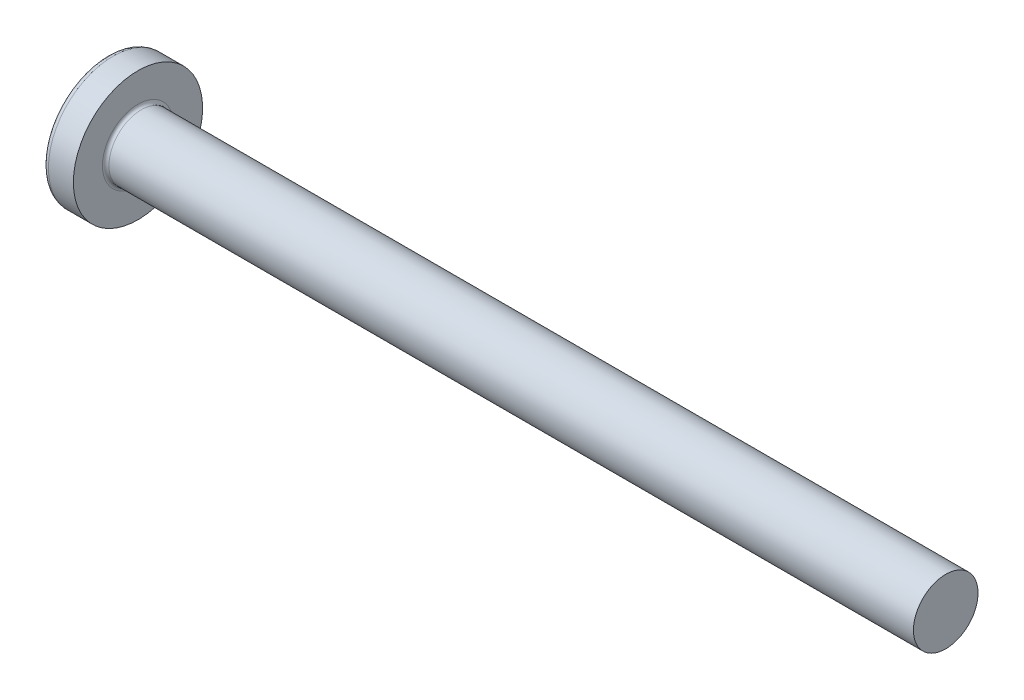
ISO-10303-21;
HEADER;
FILE_DESCRIPTION(('STEP AP214'),'2;1');
FILE_NAME('part.step','',(''),(''),'','','');
FILE_SCHEMA(('AUTOMOTIVE_DESIGN { 1 0 10303 214 1 1 1 1 }'));
ENDSEC;
DATA;
#1=APPLICATION_CONTEXT('core data for automotive mechanical design processes');
#2=APPLICATION_PROTOCOL_DEFINITION('international standard','automotive_design',2000,#1);
#3=PRODUCT_CONTEXT('',#1,'mechanical');
#4=PRODUCT('Part','Part','',(#3));
#5=PRODUCT_RELATED_PRODUCT_CATEGORY('part','',(#4));
#6=PRODUCT_DEFINITION_FORMATION('','',#4);
#7=PRODUCT_DEFINITION_CONTEXT('part definition',#1,'design');
#8=PRODUCT_DEFINITION('design','',#6,#7);
#9=PRODUCT_DEFINITION_SHAPE('','',#8);
#10=(LENGTH_UNIT() NAMED_UNIT(*) SI_UNIT(.MILLI.,.METRE.));
#11=(NAMED_UNIT(*) PLANE_ANGLE_UNIT() SI_UNIT($,.RADIAN.));
#12=(NAMED_UNIT(*) SI_UNIT($,.STERADIAN.) SOLID_ANGLE_UNIT());
#13=UNCERTAINTY_MEASURE_WITH_UNIT(LENGTH_MEASURE(1.E-05),#10,'distance_accuracy_value','');
#14=(GEOMETRIC_REPRESENTATION_CONTEXT(3) GLOBAL_UNCERTAINTY_ASSIGNED_CONTEXT((#13)) GLOBAL_UNIT_ASSIGNED_CONTEXT((#10,
#11,#12)) REPRESENTATION_CONTEXT('',''));
#15=CARTESIAN_POINT('',(0.,0.,0.));
#16=DIRECTION('',(0.,0.,1.));
#17=DIRECTION('',(1.,0.,0.));
#18=AXIS2_PLACEMENT_3D('',#15,#16,#17);
#19=CARTESIAN_POINT('',(6.5,0.,0.));
#20=DIRECTION('',(-1.,0.,0.));
#21=DIRECTION('',(0.,1.,0.));
#22=AXIS2_PLACEMENT_3D('',#19,#20,#21);
#23=SPHERICAL_SURFACE('',#22,6.5);
#24=CARTESIAN_POINT('',(1.26538895452803,0.,0.));
#25=DIRECTION('',(-1.,0.,0.));
#26=DIRECTION('',(0.,0.,1.));
#27=AXIS2_PLACEMENT_3D('',#24,#25,#26);
#28=CIRCLE('',#27,3.85342019543974);
#29=CARTESIAN_POINT('',(1.26538895452803,0.,3.85342019543974));
#30=VERTEX_POINT('',#29);
#31=EDGE_CURVE('E211',#30,#30,#28,.T.);
#32=ORIENTED_EDGE('',*,*,#31,.T.);
#33=EDGE_LOOP('',(#32));
#34=FACE_BOUND('',#33,.T.);
#35=CARTESIAN_POINT('',(0.0788099820016241,0.,0.));
#36=DIRECTION('',(1.,0.,0.));
#37=DIRECTION('',(0.,0.,-1.));
#38=AXIS2_PLACEMENT_3D('',#35,#36,#37);
#39=CIRCLE('',#38,1.0091178091571);
#40=CARTESIAN_POINT('',(0.0788099820016235,-0.514999999999997,-0.867809744562728));
#41=VERTEX_POINT('',#40);
#42=CARTESIAN_POINT('',(0.0788099820016245,-0.867809744562729,-0.515));
#43=VERTEX_POINT('',#42);
#44=EDGE_CURVE('E337',#41,#43,#39,.F.);
#45=ORIENTED_EDGE('',*,*,#44,.F.);
#46=CARTESIAN_POINT('',(6.5,-0.515,0.));
#47=DIRECTION('',(0.,1.,0.));
#48=DIRECTION('',(0.,0.,1.));
#49=AXIS2_PLACEMENT_3D('',#46,#47,#48);
#50=CIRCLE('',#49,6.47956595768575);
#51=CARTESIAN_POINT('',(0.331830514069448,-0.514999999999993,-1.98455541440274));
#52=VERTEX_POINT('',#51);
#53=EDGE_CURVE('E271',#52,#41,#50,.T.);
#54=ORIENTED_EDGE('',*,*,#53,.F.);
#55=CARTESIAN_POINT('',(6.06443205224295,0.,0.873614180207961));
#56=DIRECTION('',(0.446197800778958,0.,-0.89493436774996));
#57=DIRECTION('',(-0.89493436774996,0.,-0.446197800778958));
#58=AXIS2_PLACEMENT_3D('',#55,#56,#57);
#59=CIRCLE('',#58,6.4262803258982);
#60=CARTESIAN_POINT('',(0.331830514069448,0.515000000000007,-1.98455541440274));
#61=VERTEX_POINT('',#60);
#62=EDGE_CURVE('E245',#52,#61,#59,.T.);
#63=ORIENTED_EDGE('',*,*,#62,.T.);
#64=CARTESIAN_POINT('',(6.5,0.515,0.));
#65=DIRECTION('',(0.,-1.,0.));
#66=DIRECTION('',(0.,0.,-1.));
#67=AXIS2_PLACEMENT_3D('',#64,#65,#66);
#68=CIRCLE('',#67,6.47956595768575);
#69=CARTESIAN_POINT('',(0.0788099820016234,0.515000000000003,-0.867809744562724));
#70=VERTEX_POINT('',#69);
#71=EDGE_CURVE('E299',#70,#61,#68,.T.);
#72=ORIENTED_EDGE('',*,*,#71,.F.);
#73=CARTESIAN_POINT('',(0.0788099820016245,0.86780974456273,-0.515));
#74=VERTEX_POINT('',#73);
#75=EDGE_CURVE('E352',#74,#70,#39,.F.);
#76=ORIENTED_EDGE('',*,*,#75,.F.);
#77=CARTESIAN_POINT('',(6.5,0.,-0.515));
#78=DIRECTION('',(0.,0.,1.));
#79=DIRECTION('',(1.,0.,0.));
#80=AXIS2_PLACEMENT_3D('',#77,#78,#79);
#81=CIRCLE('',#80,6.47956595768575);
#82=CARTESIAN_POINT('',(0.331830514069446,1.98455541440274,-0.515));
#83=VERTEX_POINT('',#82);
#84=EDGE_CURVE('E239',#83,#74,#81,.T.);
#85=ORIENTED_EDGE('',*,*,#84,.F.);
#86=CARTESIAN_POINT('',(6.06443205224295,-0.873614180207961,0.));
#87=DIRECTION('',(0.446197800778958,0.89493436774996,0.));
#88=DIRECTION('',(-0.89493436774996,0.446197800778958,0.));
#89=AXIS2_PLACEMENT_3D('',#86,#87,#88);
#90=CIRCLE('',#89,6.4262803258982);
#91=CARTESIAN_POINT('',(0.331830514069447,1.98455541440274,0.515));
#92=VERTEX_POINT('',#91);
#93=EDGE_CURVE('E242',#83,#92,#90,.T.);
#94=ORIENTED_EDGE('',*,*,#93,.T.);
#95=CARTESIAN_POINT('',(6.5,0.,0.515));
#96=DIRECTION('',(0.,0.,-1.));
#97=DIRECTION('',(0.,1.,0.));
#98=AXIS2_PLACEMENT_3D('',#95,#96,#97);
#99=CIRCLE('',#98,6.47956595768575);
#100=CARTESIAN_POINT('',(0.0788099820016241,0.867809744562726,0.515));
#101=VERTEX_POINT('',#100);
#102=EDGE_CURVE('E235',#101,#92,#99,.T.);
#103=ORIENTED_EDGE('',*,*,#102,.F.);
#104=CARTESIAN_POINT('',(0.0788099820016234,0.514999999999997,0.867809744562728));
#105=VERTEX_POINT('',#104);
#106=EDGE_CURVE('E351',#105,#101,#39,.F.);
#107=ORIENTED_EDGE('',*,*,#106,.F.);
#108=CARTESIAN_POINT('',(0.331830514069447,0.514999999999993,1.98455541440274));
#109=VERTEX_POINT('',#108);
#110=EDGE_CURVE('E255',#109,#105,#68,.T.);
#111=ORIENTED_EDGE('',*,*,#110,.F.);
#112=CARTESIAN_POINT('',(6.06443205224295,0.,-0.873614180207961));
#113=DIRECTION('',(0.446197800778958,0.,0.89493436774996));
#114=DIRECTION('',(0.89493436774996,0.,-0.446197800778958));
#115=AXIS2_PLACEMENT_3D('',#112,#113,#114);
#116=CIRCLE('',#115,6.4262803258982);
#117=CARTESIAN_POINT('',(0.331830514069447,-0.515000000000007,1.98455541440274));
#118=VERTEX_POINT('',#117);
#119=EDGE_CURVE('E46',#109,#118,#116,.T.);
#120=ORIENTED_EDGE('',*,*,#119,.T.);
#121=CARTESIAN_POINT('',(0.0788099820016234,-0.515000000000003,0.867809744562724));
#122=VERTEX_POINT('',#121);
#123=EDGE_CURVE('E252',#122,#118,#50,.T.);
#124=ORIENTED_EDGE('',*,*,#123,.F.);
#125=CARTESIAN_POINT('',(0.0788099820016241,-0.867809744562726,0.515));
#126=VERTEX_POINT('',#125);
#127=EDGE_CURVE('E383',#126,#122,#39,.F.);
#128=ORIENTED_EDGE('',*,*,#127,.F.);
#129=CARTESIAN_POINT('',(0.331830514069448,-1.98455541440274,0.515));
#130=VERTEX_POINT('',#129);
#131=EDGE_CURVE('E236',#130,#126,#99,.T.);
#132=ORIENTED_EDGE('',*,*,#131,.F.);
#133=CARTESIAN_POINT('',(6.06443205224295,0.873614180207961,0.));
#134=DIRECTION('',(0.446197800778958,-0.89493436774996,0.));
#135=DIRECTION('',(0.89493436774996,0.446197800778958,0.));
#136=AXIS2_PLACEMENT_3D('',#133,#134,#135);
#137=CIRCLE('',#136,6.4262803258982);
#138=CARTESIAN_POINT('',(0.331830514069448,-1.98455541440274,-0.515));
#139=VERTEX_POINT('',#138);
#140=EDGE_CURVE('E232',#130,#139,#137,.T.);
#141=ORIENTED_EDGE('',*,*,#140,.T.);
#142=EDGE_CURVE('E61',#43,#139,#81,.T.);
#143=ORIENTED_EDGE('',*,*,#142,.F.);
#144=EDGE_LOOP('',(#45,#54,#63,#72,#76,#85,#94,#103,#107,#111,#120,#124,#128,#132,#141,#143));
#145=FACE_BOUND('',#144,.T.);
#146=ADVANCED_FACE('F33',(#34,#145),#23,.T.);
#147=CARTESIAN_POINT('',(0.,2.15,-0.515));
#148=DIRECTION('',(0.,0.,1.));
#149=DIRECTION('',(1.,0.,0.));
#150=AXIS2_PLACEMENT_3D('',#147,#148,#149);
#151=PLANE('',#150);
#152=ORIENTED_EDGE('',*,*,#84,.T.);
#153=CARTESIAN_POINT('',(-1.51195208675156,0.994972220320188,-0.515));
#154=CARTESIAN_POINT('',(-1.2040598194928,0.970722016949958,-0.515));
#155=CARTESIAN_POINT('',(-0.896180907521175,0.946299109919651,-0.515));
#156=CARTESIAN_POINT('',(-0.280449079832186,0.896981122427851,-0.515));
#157=CARTESIAN_POINT('',(0.0274038344396859,0.872086023934883,-0.515));
#158=CARTESIAN_POINT('',(0.48914673951535,0.83429553519528,-0.515));
#159=CARTESIAN_POINT('',(0.643055047553845,0.821624058404092,-0.515));
#160=CARTESIAN_POINT('',(0.950856520197139,0.796108332639504,-0.515));
#161=CARTESIAN_POINT('',(1.10474968487868,0.783264084592466,-0.515));
#162=CARTESIAN_POINT('',(1.41251352095103,0.757376569093378,-0.515));
#163=CARTESIAN_POINT('',(1.56638419296577,0.744333309065218,-0.515));
#164=CARTESIAN_POINT('',(1.87410847343335,0.718013273188896,-0.515));
#165=CARTESIAN_POINT('',(2.02796208151372,0.704736492982792,-0.515));
#166=CARTESIAN_POINT('',(2.36455311890989,0.675386943006726,-0.515));
#167=CARTESIAN_POINT('',(2.54728562293342,0.659257575640986,-0.515));
#168=CARTESIAN_POINT('',(2.91270624109256,0.626517182479888,-0.515));
#169=CARTESIAN_POINT('',(3.09539435554038,0.609906160177238,-0.515));
#170=CARTESIAN_POINT('',(3.46069832191613,0.576073027116421,-0.515));
#171=CARTESIAN_POINT('',(3.64331417870068,0.558850968932727,-0.515));
#172=CARTESIAN_POINT('',(4.00847437496567,0.523604864540037,-0.515));
#173=CARTESIAN_POINT('',(4.19101871216888,0.505580794604253,-0.515));
#174=CARTESIAN_POINT('',(4.55606208157937,0.468429191666488,-0.515));
#175=CARTESIAN_POINT('',(4.73856107358023,0.449301262281854,-0.515));
#176=CARTESIAN_POINT('',(5.10337547353419,0.409473604748924,-0.515));
#177=CARTESIAN_POINT('',(5.28569089526422,0.388774005106069,-0.515));
#178=CARTESIAN_POINT('',(5.55897278495412,0.355828287527264,-0.515));
#179=CARTESIAN_POINT('',(5.65005277419686,0.344527918782738,-0.515));
#180=CARTESIAN_POINT('',(5.83209904103608,0.321075174263031,-0.515));
#181=CARTESIAN_POINT('',(5.92306532397915,0.308922840209686,-0.515));
#182=CARTESIAN_POINT('',(6.10486078872898,0.28342733445193,-0.515));
#183=CARTESIAN_POINT('',(6.1956899229938,0.270083817601714,-0.515));
#184=CARTESIAN_POINT('',(6.33172773785679,0.248701420809951,-0.515));
#185=CARTESIAN_POINT('',(6.37704304473344,0.241345446705304,-0.515));
#186=CARTESIAN_POINT('',(6.4675722520141,0.226018953559338,-0.515));
#187=CARTESIAN_POINT('',(6.51278614568083,0.218048394864476,-0.515));
#188=CARTESIAN_POINT('',(6.55793125759549,0.209691465274944,-0.515));
#189=B_SPLINE_CURVE_WITH_KNOTS('',3,(#153,#154,#155,#156,#157,#158,#159,#160,#161,#162,#163,
#164,#165,#166,#167,#168,#169,#170,#171,#172,#173,#174,#175,#176,#177,#178,#179,#180,#181,#182,
#183,#184,#185,#186,#187,#188),.UNSPECIFIED.,.F.,.F.,(4,2,2,2,2,2,2,2,2,2,2,2,2,2,2,2,2,4),(0.,
0.926537709781721,1.85311087258339,2.31639796016285,2.77968256468771,3.24294992902055,
3.70622594801777,4.25655436065378,4.80687878359543,5.35715597005738,5.90744944680718,
6.45794177197673,7.008389135274,7.28372117336899,7.55903973750591,7.83443833587749,
7.97216007460855,8.10989070671571),.UNSPECIFIED.);
#190=CARTESIAN_POINT('',(2.34,0.677477674908923,-0.515));
#191=VERTEX_POINT('',#190);
#192=EDGE_CURVE('E372',#74,#191,#189,.T.);
#193=ORIENTED_EDGE('',*,*,#192,.T.);
#194=DIRECTION('',(0.,1.,0.));
#195=VECTOR('',#194,1.);
#196=CARTESIAN_POINT('',(2.34,-0.983319077411408,-0.515));
#197=LINE('',#196,#195);
#198=CARTESIAN_POINT('',(2.34,0.983319077411408,-0.515));
#199=VERTEX_POINT('',#198);
#200=EDGE_CURVE('E320',#191,#199,#197,.T.);
#201=ORIENTED_EDGE('',*,*,#200,.T.);
#202=DIRECTION('',(0.89493436774996,-0.446197800778958,0.));
#203=VECTOR('',#202,1.);
#204=CARTESIAN_POINT('',(0.,2.15,-0.515));
#205=LINE('',#204,#203);
#206=EDGE_CURVE('E212',#83,#199,#205,.T.);
#207=ORIENTED_EDGE('',*,*,#206,.F.);
#208=EDGE_LOOP('',(#152,#193,#201,#207));
#209=FACE_BOUND('',#208,.T.);
#210=ADVANCED_FACE('F167',(#209),#151,.T.);
#211=CARTESIAN_POINT('',(2.34,-0.983319077411408,-0.515));
#212=VERTEX_POINT('',#211);
#213=CARTESIAN_POINT('',(2.34,-0.677477674908923,-0.515));
#214=VERTEX_POINT('',#213);
#215=EDGE_CURVE('E220',#212,#214,#197,.T.);
#216=ORIENTED_EDGE('',*,*,#215,.T.);
#217=CARTESIAN_POINT('',(-1.51195208675156,-0.994972220320188,-0.515));
#218=CARTESIAN_POINT('',(-1.2040598194928,-0.970722016949958,-0.515));
#219=CARTESIAN_POINT('',(-0.896180907521175,-0.946299109919651,-0.515));
#220=CARTESIAN_POINT('',(-0.280449079832186,-0.896981122427851,-0.515));
#221=CARTESIAN_POINT('',(0.027403834439686,-0.872086023934883,-0.515));
#222=CARTESIAN_POINT('',(0.489146739515349,-0.83429553519528,-0.515));
#223=CARTESIAN_POINT('',(0.643055047553845,-0.821624058404092,-0.515));
#224=CARTESIAN_POINT('',(0.950856520197139,-0.796108332639504,-0.515));
#225=CARTESIAN_POINT('',(1.10474968487868,-0.783264084592466,-0.515));
#226=CARTESIAN_POINT('',(1.41251352095103,-0.757376569093378,-0.515));
#227=CARTESIAN_POINT('',(1.56638419296577,-0.744333309065218,-0.515));
#228=CARTESIAN_POINT('',(1.87410847343335,-0.718013273188896,-0.515));
#229=CARTESIAN_POINT('',(2.02796208151372,-0.704736492982792,-0.515));
#230=CARTESIAN_POINT('',(2.36455311890989,-0.675386943006726,-0.515));
#231=CARTESIAN_POINT('',(2.54728562293342,-0.659257575640986,-0.515));
#232=CARTESIAN_POINT('',(2.91270624109256,-0.626517182479888,-0.515));
#233=CARTESIAN_POINT('',(3.09539435554038,-0.609906160177238,-0.515));
#234=CARTESIAN_POINT('',(3.46069832191612,-0.576073027116421,-0.515));
#235=CARTESIAN_POINT('',(3.64331417870068,-0.558850968932727,-0.515));
#236=CARTESIAN_POINT('',(4.00847437496567,-0.523604864540037,-0.515));
#237=CARTESIAN_POINT('',(4.19101871216888,-0.505580794604253,-0.515));
#238=CARTESIAN_POINT('',(4.55606208157937,-0.468429191666488,-0.515));
#239=CARTESIAN_POINT('',(4.73856107358023,-0.449301262281854,-0.515));
#240=CARTESIAN_POINT('',(5.10337547353419,-0.409473604748924,-0.515));
#241=CARTESIAN_POINT('',(5.28569089526422,-0.388774005106069,-0.515));
#242=CARTESIAN_POINT('',(5.55897278495412,-0.355828287527264,-0.515));
#243=CARTESIAN_POINT('',(5.65005277419686,-0.344527918782738,-0.515));
#244=CARTESIAN_POINT('',(5.83209904103608,-0.321075174263031,-0.515));
#245=CARTESIAN_POINT('',(5.92306532397915,-0.308922840209686,-0.515));
#246=CARTESIAN_POINT('',(6.10486078872898,-0.28342733445193,-0.515));
#247=CARTESIAN_POINT('',(6.1956899229938,-0.270083817601714,-0.515));
#248=CARTESIAN_POINT('',(6.3317277378568,-0.24870142080995,-0.515));
#249=CARTESIAN_POINT('',(6.37704304473344,-0.241345446705303,-0.515));
#250=CARTESIAN_POINT('',(6.4675722520141,-0.226018953559337,-0.515));
#251=CARTESIAN_POINT('',(6.51278614568083,-0.218048394864476,-0.515));
#252=CARTESIAN_POINT('',(6.55793125759549,-0.209691465274944,-0.515));
#253=B_SPLINE_CURVE_WITH_KNOTS('',3,(#217,#218,#219,#220,#221,#222,#223,#224,#225,#226,#227,
#228,#229,#230,#231,#232,#233,#234,#235,#236,#237,#238,#239,#240,#241,#242,#243,#244,#245,#246,
#247,#248,#249,#250,#251,#252),.UNSPECIFIED.,.F.,.F.,(4,2,2,2,2,2,2,2,2,2,2,2,2,2,2,2,2,4),(0.,
0.926537709781721,1.85311087258339,2.31639796016285,2.77968256468771,3.24294992902055,
3.70622594801777,4.25655436065378,4.80687878359543,5.35715597005738,5.90744944680718,
6.45794177197673,7.008389135274,7.28372117336899,7.55903973750591,7.83443833587749,
7.97216007460855,8.10989070671572),.UNSPECIFIED.);
#254=EDGE_CURVE('E350',#214,#43,#253,.F.);
#255=ORIENTED_EDGE('',*,*,#254,.T.);
#256=ORIENTED_EDGE('',*,*,#142,.T.);
#257=DIRECTION('',(0.89493436774996,0.446197800778958,0.));
#258=VECTOR('',#257,1.);
#259=CARTESIAN_POINT('',(0.,-2.15,-0.515));
#260=LINE('',#259,#258);
#261=EDGE_CURVE('E302',#139,#212,#260,.T.);
#262=ORIENTED_EDGE('',*,*,#261,.T.);
#263=EDGE_LOOP('',(#216,#255,#256,#262));
#264=FACE_BOUND('',#263,.T.);
#265=ADVANCED_FACE('F173',(#264),#151,.T.);
#266=CARTESIAN_POINT('',(0.,-2.15,0.515));
#267=DIRECTION('',(0.,0.,-1.));
#268=DIRECTION('',(0.,1.,0.));
#269=AXIS2_PLACEMENT_3D('',#266,#267,#268);
#270=PLANE('',#269);
#271=DIRECTION('',(0.,-1.,0.));
#272=VECTOR('',#271,1.);
#273=CARTESIAN_POINT('',(2.34,0.983319077411408,0.515));
#274=LINE('',#273,#272);
#275=CARTESIAN_POINT('',(2.34,0.983319077411408,0.515));
#276=VERTEX_POINT('',#275);
#277=CARTESIAN_POINT('',(2.34,0.677477674908923,0.515));
#278=VERTEX_POINT('',#277);
#279=EDGE_CURVE('E310',#276,#278,#274,.T.);
#280=ORIENTED_EDGE('',*,*,#279,.T.);
#281=CARTESIAN_POINT('',(-1.51195208675156,0.994972220320187,0.515));
#282=CARTESIAN_POINT('',(-1.2040598194928,0.970722016949958,0.515));
#283=CARTESIAN_POINT('',(-0.896180907521175,0.946299109919651,0.515));
#284=CARTESIAN_POINT('',(-0.280449079832186,0.896981122427851,0.515));
#285=CARTESIAN_POINT('',(0.0274038344396859,0.872086023934883,0.515));
#286=CARTESIAN_POINT('',(0.489146739515349,0.83429553519528,0.515));
#287=CARTESIAN_POINT('',(0.643055047553845,0.821624058404092,0.515));
#288=CARTESIAN_POINT('',(0.950856520197139,0.796108332639504,0.515));
#289=CARTESIAN_POINT('',(1.10474968487868,0.783264084592466,0.515));
#290=CARTESIAN_POINT('',(1.41251352095103,0.757376569093378,0.515));
#291=CARTESIAN_POINT('',(1.56638419296577,0.744333309065218,0.515));
#292=CARTESIAN_POINT('',(1.87410847343335,0.718013273188896,0.515));
#293=CARTESIAN_POINT('',(2.02796208151372,0.704736492982792,0.515));
#294=CARTESIAN_POINT('',(2.36455311890989,0.675386943006726,0.515));
#295=CARTESIAN_POINT('',(2.54728562293342,0.659257575640986,0.515));
#296=CARTESIAN_POINT('',(2.91270624109256,0.626517182479888,0.515));
#297=CARTESIAN_POINT('',(3.09539435554037,0.609906160177238,0.515));
#298=CARTESIAN_POINT('',(3.46069832191612,0.576073027116421,0.515));
#299=CARTESIAN_POINT('',(3.64331417870068,0.558850968932727,0.515));
#300=CARTESIAN_POINT('',(4.00847437496567,0.523604864540037,0.515));
#301=CARTESIAN_POINT('',(4.19101871216888,0.505580794604253,0.515));
#302=CARTESIAN_POINT('',(4.55606208157937,0.468429191666488,0.515));
#303=CARTESIAN_POINT('',(4.73856107358023,0.449301262281853,0.515));
#304=CARTESIAN_POINT('',(5.10337547353419,0.409473604748924,0.515));
#305=CARTESIAN_POINT('',(5.28569089526422,0.38877400510607,0.515));
#306=CARTESIAN_POINT('',(5.55897278495412,0.355828287527264,0.515));
#307=CARTESIAN_POINT('',(5.65005277419686,0.344527918782738,0.515));
#308=CARTESIAN_POINT('',(5.83209904103608,0.321075174263031,0.515));
#309=CARTESIAN_POINT('',(5.92306532397915,0.308922840209686,0.515));
#310=CARTESIAN_POINT('',(6.10486078872898,0.28342733445193,0.515));
#311=CARTESIAN_POINT('',(6.1956899229938,0.270083817601714,0.515));
#312=CARTESIAN_POINT('',(6.3317277378568,0.248701420809951,0.515));
#313=CARTESIAN_POINT('',(6.37704304473344,0.241345446705304,0.515));
#314=CARTESIAN_POINT('',(6.4675722520141,0.226018953559338,0.515));
#315=CARTESIAN_POINT('',(6.51278614568083,0.218048394864476,0.515));
#316=CARTESIAN_POINT('',(6.55793125759549,0.209691465274944,0.515));
#317=B_SPLINE_CURVE_WITH_KNOTS('',3,(#281,#282,#283,#284,#285,#286,#287,#288,#289,#290,#291,
#292,#293,#294,#295,#296,#297,#298,#299,#300,#301,#302,#303,#304,#305,#306,#307,#308,#309,#310,
#311,#312,#313,#314,#315,#316),.UNSPECIFIED.,.F.,.F.,(4,2,2,2,2,2,2,2,2,2,2,2,2,2,2,2,2,4),(0.,
0.926537709781721,1.85311087258339,2.31639796016285,2.77968256468771,3.24294992902054,
3.70622594801777,4.25655436065378,4.80687878359543,5.35715597005738,5.90744944680718,
6.45794177197673,7.008389135274,7.28372117336899,7.55903973750591,7.83443833587749,
7.97216007460855,8.10989070671572),.UNSPECIFIED.);
#318=EDGE_CURVE('E276',#278,#101,#317,.F.);
#319=ORIENTED_EDGE('',*,*,#318,.T.);
#320=ORIENTED_EDGE('',*,*,#102,.T.);
#321=DIRECTION('',(0.89493436774996,-0.446197800778958,0.));
#322=VECTOR('',#321,1.);
#323=CARTESIAN_POINT('',(0.,2.15,0.515));
#324=LINE('',#323,#322);
#325=EDGE_CURVE('E217',#92,#276,#324,.T.);
#326=ORIENTED_EDGE('',*,*,#325,.T.);
#327=EDGE_LOOP('',(#280,#319,#320,#326));
#328=FACE_BOUND('',#327,.T.);
#329=ADVANCED_FACE('F368',(#328),#270,.T.);
#330=ORIENTED_EDGE('',*,*,#131,.T.);
#331=CARTESIAN_POINT('',(-1.51195208675156,-0.994972220320188,0.515));
#332=CARTESIAN_POINT('',(-1.2040598194928,-0.970722016949958,0.515));
#333=CARTESIAN_POINT('',(-0.896180907521175,-0.946299109919651,0.515));
#334=CARTESIAN_POINT('',(-0.280449079832186,-0.896981122427852,0.515));
#335=CARTESIAN_POINT('',(0.0274038344396859,-0.872086023934883,0.515));
#336=CARTESIAN_POINT('',(0.48914673951535,-0.83429553519528,0.515));
#337=CARTESIAN_POINT('',(0.643055047553845,-0.821624058404092,0.515));
#338=CARTESIAN_POINT('',(0.950856520197139,-0.796108332639504,0.515));
#339=CARTESIAN_POINT('',(1.10474968487868,-0.783264084592466,0.515));
#340=CARTESIAN_POINT('',(1.41251352095103,-0.757376569093379,0.515));
#341=CARTESIAN_POINT('',(1.56638419296577,-0.744333309065218,0.515));
#342=CARTESIAN_POINT('',(1.87410847343335,-0.718013273188896,0.515));
#343=CARTESIAN_POINT('',(2.02796208151372,-0.704736492982792,0.515));
#344=CARTESIAN_POINT('',(2.36455311890989,-0.675386943006726,0.515));
#345=CARTESIAN_POINT('',(2.54728562293342,-0.659257575640986,0.515));
#346=CARTESIAN_POINT('',(2.91270624109256,-0.626517182479888,0.515));
#347=CARTESIAN_POINT('',(3.09539435554038,-0.609906160177238,0.515));
#348=CARTESIAN_POINT('',(3.46069832191613,-0.576073027116422,0.515));
#349=CARTESIAN_POINT('',(3.64331417870068,-0.558850968932728,0.515));
#350=CARTESIAN_POINT('',(4.00847437496567,-0.523604864540037,0.515));
#351=CARTESIAN_POINT('',(4.19101871216888,-0.505580794604253,0.515));
#352=CARTESIAN_POINT('',(4.55606208157937,-0.468429191666488,0.515));
#353=CARTESIAN_POINT('',(4.73856107358023,-0.449301262281854,0.515));
#354=CARTESIAN_POINT('',(5.10337547353419,-0.409473604748924,0.515));
#355=CARTESIAN_POINT('',(5.28569089526422,-0.38877400510607,0.515));
#356=CARTESIAN_POINT('',(5.55897278495412,-0.355828287527264,0.515));
#357=CARTESIAN_POINT('',(5.65005277419686,-0.344527918782739,0.515));
#358=CARTESIAN_POINT('',(5.83209904103608,-0.321075174263031,0.515));
#359=CARTESIAN_POINT('',(5.92306532397915,-0.308922840209686,0.515));
#360=CARTESIAN_POINT('',(6.10486078872898,-0.28342733445193,0.515));
#361=CARTESIAN_POINT('',(6.1956899229938,-0.270083817601714,0.515));
#362=CARTESIAN_POINT('',(6.33172773785679,-0.248701420809951,0.515));
#363=CARTESIAN_POINT('',(6.37704304473344,-0.241345446705304,0.515));
#364=CARTESIAN_POINT('',(6.4675722520141,-0.226018953559338,0.515));
#365=CARTESIAN_POINT('',(6.51278614568083,-0.218048394864477,0.515));
#366=CARTESIAN_POINT('',(6.55793125759549,-0.209691465274945,0.515));
#367=B_SPLINE_CURVE_WITH_KNOTS('',3,(#331,#332,#333,#334,#335,#336,#337,#338,#339,#340,#341,
#342,#343,#344,#345,#346,#347,#348,#349,#350,#351,#352,#353,#354,#355,#356,#357,#358,#359,#360,
#361,#362,#363,#364,#365,#366),.UNSPECIFIED.,.F.,.F.,(4,2,2,2,2,2,2,2,2,2,2,2,2,2,2,2,2,4),(0.,
0.926537709781721,1.85311087258339,2.31639796016285,2.77968256468771,3.24294992902055,
3.70622594801777,4.25655436065378,4.80687878359543,5.35715597005738,5.90744944680718,
6.45794177197673,7.008389135274,7.28372117336899,7.55903973750591,7.83443833587749,
7.97216007460855,8.10989070671571),.UNSPECIFIED.);
#368=CARTESIAN_POINT('',(2.34,-0.677477674908923,0.515));
#369=VERTEX_POINT('',#368);
#370=EDGE_CURVE('E384',#126,#369,#367,.T.);
#371=ORIENTED_EDGE('',*,*,#370,.T.);
#372=CARTESIAN_POINT('',(2.34,-0.983319077411408,0.515));
#373=VERTEX_POINT('',#372);
#374=EDGE_CURVE('E312',#369,#373,#274,.T.);
#375=ORIENTED_EDGE('',*,*,#374,.T.);
#376=DIRECTION('',(0.89493436774996,0.446197800778958,0.));
#377=VECTOR('',#376,1.);
#378=CARTESIAN_POINT('',(0.,-2.15,0.515));
#379=LINE('',#378,#377);
#380=EDGE_CURVE('E304',#130,#373,#379,.T.);
#381=ORIENTED_EDGE('',*,*,#380,.F.);
#382=EDGE_LOOP('',(#330,#371,#375,#381));
#383=FACE_BOUND('',#382,.T.);
#384=ADVANCED_FACE('F411',(#383),#270,.T.);
#385=CARTESIAN_POINT('',(2.34,0.983319077411408,-0.515));
#386=DIRECTION('',(-1.,0.,0.));
#387=DIRECTION('',(0.,0.,1.));
#388=AXIS2_PLACEMENT_3D('',#385,#386,#387);
#389=PLANE('',#388);
#390=ORIENTED_EDGE('',*,*,#374,.F.);
#391=CARTESIAN_POINT('',(2.34,0.,0.));
#392=DIRECTION('',(-1.,0.,0.));
#393=DIRECTION('',(0.,0.,1.));
#394=AXIS2_PLACEMENT_3D('',#391,#392,#393);
#395=CIRCLE('',#394,0.851);
#396=EDGE_CURVE('E345',#214,#369,#395,.T.);
#397=ORIENTED_EDGE('',*,*,#396,.F.);
#398=ORIENTED_EDGE('',*,*,#215,.F.);
#399=DIRECTION('',(0.,0.,1.));
#400=VECTOR('',#399,1.);
#401=CARTESIAN_POINT('',(2.34,-0.983319077411408,-0.515));
#402=LINE('',#401,#400);
#403=EDGE_CURVE('E307',#212,#373,#402,.T.);
#404=ORIENTED_EDGE('',*,*,#403,.T.);
#405=EDGE_LOOP('',(#390,#397,#398,#404));
#406=FACE_BOUND('',#405,.T.);
#407=ADVANCED_FACE('F409',(#406),#389,.T.);
#408=DIRECTION('',(0.,0.,-1.));
#409=VECTOR('',#408,1.);
#410=CARTESIAN_POINT('',(2.34,-0.515000000000004,0.983319077411407));
#411=LINE('',#410,#409);
#412=CARTESIAN_POINT('',(2.34,-0.514999999999998,-0.677477674908925));
#413=VERTEX_POINT('',#412);
#414=CARTESIAN_POINT('',(2.34,-0.514999999999996,-0.98331907741141));
#415=VERTEX_POINT('',#414);
#416=EDGE_CURVE('E293',#413,#415,#411,.T.);
#417=ORIENTED_EDGE('',*,*,#416,.F.);
#418=CARTESIAN_POINT('',(2.34,0.515000000000002,-0.677477674908921));
#419=VERTEX_POINT('',#418);
#420=EDGE_CURVE('E53',#419,#413,#395,.T.);
#421=ORIENTED_EDGE('',*,*,#420,.F.);
#422=DIRECTION('',(0.,0.,1.));
#423=VECTOR('',#422,1.);
#424=CARTESIAN_POINT('',(2.34,0.515000000000004,-0.983319077411407));
#425=LINE('',#424,#423);
#426=CARTESIAN_POINT('',(2.34,0.515000000000004,-0.983319077411407));
#427=VERTEX_POINT('',#426);
#428=EDGE_CURVE('E296',#427,#419,#425,.T.);
#429=ORIENTED_EDGE('',*,*,#428,.F.);
#430=DIRECTION('',(0.,-1.,0.));
#431=VECTOR('',#430,1.);
#432=CARTESIAN_POINT('',(2.34,0.515000000000004,-0.983319077411407));
#433=LINE('',#432,#431);
#434=EDGE_CURVE('E287',#427,#415,#433,.T.);
#435=ORIENTED_EDGE('',*,*,#434,.T.);
#436=EDGE_LOOP('',(#417,#421,#429,#435));
#437=FACE_BOUND('',#436,.T.);
#438=ADVANCED_FACE('F340',(#437),#389,.T.);
#439=ORIENTED_EDGE('',*,*,#200,.F.);
#440=EDGE_CURVE('E344',#278,#191,#395,.T.);
#441=ORIENTED_EDGE('',*,*,#440,.F.);
#442=ORIENTED_EDGE('',*,*,#279,.F.);
#443=DIRECTION('',(0.,0.,-1.));
#444=VECTOR('',#443,1.);
#445=CARTESIAN_POINT('',(2.34,0.983319077411408,0.515));
#446=LINE('',#445,#444);
#447=EDGE_CURVE('E313',#276,#199,#446,.T.);
#448=ORIENTED_EDGE('',*,*,#447,.T.);
#449=EDGE_LOOP('',(#439,#441,#442,#448));
#450=FACE_BOUND('',#449,.T.);
#451=ADVANCED_FACE('F418',(#450),#389,.T.);
#452=CARTESIAN_POINT('',(2.34,0.514999999999998,0.677477674908924));
#453=VERTEX_POINT('',#452);
#454=CARTESIAN_POINT('',(2.34,0.514999999999997,0.98331907741141));
#455=VERTEX_POINT('',#454);
#456=EDGE_CURVE('E269',#453,#455,#425,.T.);
#457=ORIENTED_EDGE('',*,*,#456,.F.);
#458=CARTESIAN_POINT('',(2.34,-0.515000000000003,0.677477674908921));
#459=VERTEX_POINT('',#458);
#460=EDGE_CURVE('E348',#459,#453,#395,.T.);
#461=ORIENTED_EDGE('',*,*,#460,.F.);
#462=CARTESIAN_POINT('',(2.34,-0.515000000000004,0.983319077411407));
#463=VERTEX_POINT('',#462);
#464=EDGE_CURVE('E290',#463,#459,#411,.T.);
#465=ORIENTED_EDGE('',*,*,#464,.F.);
#466=DIRECTION('',(0.,1.,0.));
#467=VECTOR('',#466,1.);
#468=CARTESIAN_POINT('',(2.34,-0.515000000000004,0.983319077411407));
#469=LINE('',#468,#467);
#470=EDGE_CURVE('E294',#463,#455,#469,.T.);
#471=ORIENTED_EDGE('',*,*,#470,.T.);
#472=EDGE_LOOP('',(#457,#461,#465,#471));
#473=FACE_BOUND('',#472,.T.);
#474=ADVANCED_FACE('F413',(#473),#389,.T.);
#475=CARTESIAN_POINT('',(0.,0.514999999999993,2.15));
#476=DIRECTION('',(0.,-1.,0.));
#477=DIRECTION('',(1.,0.,0.));
#478=AXIS2_PLACEMENT_3D('',#475,#476,#477);
#479=PLANE('',#478);
#480=ORIENTED_EDGE('',*,*,#110,.T.);
#481=CARTESIAN_POINT('',(-1.51195208754038,0.514999999999997,0.994972220382299));
#482=CARTESIAN_POINT('',(-1.20405982018868,0.514999999999997,0.970722017005066));
#483=CARTESIAN_POINT('',(-0.896180908124145,0.514999999999997,0.94629910996769));
#484=CARTESIAN_POINT('',(-0.280449080249314,0.514999999999997,0.896981122461529));
#485=CARTESIAN_POINT('',(0.0274038341154838,0.514999999999997,0.872086023961266));
#486=CARTESIAN_POINT('',(0.489146739371407,0.514999999999997,0.834295535207138));
#487=CARTESIAN_POINT('',(0.643055047497244,0.514999999999997,0.821624058408798));
#488=CARTESIAN_POINT('',(0.950856520315202,0.514999999999997,0.796108332629707));
#489=CARTESIAN_POINT('',(1.10474968508407,0.514999999999997,0.783264084575319));
#490=CARTESIAN_POINT('',(1.41251352133103,0.514999999999997,0.757376569061289));
#491=CARTESIAN_POINT('',(1.56638419343305,0.514999999999997,0.744333309025535));
#492=CARTESIAN_POINT('',(1.87410847407519,0.514999999999998,0.718013273133717));
#493=CARTESIAN_POINT('',(2.02796208224283,0.514999999999998,0.704736492919711));
#494=CARTESIAN_POINT('',(2.36455311972626,0.514999999999998,0.675386942934958));
#495=CARTESIAN_POINT('',(2.5472856237498,0.514999999999998,0.65925757556857));
#496=CARTESIAN_POINT('',(2.91270624190895,0.514999999999998,0.626517182406015));
#497=CARTESIAN_POINT('',(3.09539435635676,0.514999999999998,0.609906160102556));
#498=CARTESIAN_POINT('',(3.46069832273244,0.514999999999998,0.576073027039891));
#499=CARTESIAN_POINT('',(3.64331417951694,0.514999999999998,0.558850968855158));
#500=CARTESIAN_POINT('',(4.00847437578178,0.514999999999998,0.523604864460046));
#501=CARTESIAN_POINT('',(4.1910187129849,0.514999999999998,0.505580794522878));
#502=CARTESIAN_POINT('',(4.55606208239526,0.514999999999998,0.468429191581782));
#503=CARTESIAN_POINT('',(4.73856107439606,0.514999999999999,0.449301262195199));
#504=CARTESIAN_POINT('',(5.10337547434977,0.514999999999999,0.409473604657437));
#505=CARTESIAN_POINT('',(5.28569089607961,0.514999999999999,0.388774005011697));
#506=CARTESIAN_POINT('',(5.55897278576906,0.514999999999999,0.355828287427084));
#507=CARTESIAN_POINT('',(5.65005277501166,0.514999999999999,0.344527918680371));
#508=CARTESIAN_POINT('',(5.83209904185046,0.514999999999999,0.321075174155502));
#509=CARTESIAN_POINT('',(5.92306532479326,0.514999999999999,0.308922840099183));
#510=CARTESIAN_POINT('',(6.10486078954238,0.514999999999999,0.283427334334155));
#511=CARTESIAN_POINT('',(6.19568992380676,0.514999999999999,0.270083817479639));
#512=CARTESIAN_POINT('',(6.33172773866874,0.514999999999999,0.248701420679481));
#513=CARTESIAN_POINT('',(6.377043045545,0.514999999999999,0.241345446571709));
#514=CARTESIAN_POINT('',(6.46757225282465,0.514999999999999,0.226018953418426));
#515=CARTESIAN_POINT('',(6.51278614649077,0.514999999999999,0.218048394719371));
#516=CARTESIAN_POINT('',(6.55793125840465,0.514999999999999,0.209691465124903));
#517=B_SPLINE_CURVE_WITH_KNOTS('',3,(#481,#482,#483,#484,#485,#486,#487,#488,#489,#490,#491,
#492,#493,#494,#495,#496,#497,#498,#499,#500,#501,#502,#503,#504,#505,#506,#507,#508,#509,#510,
#511,#512,#513,#514,#515,#516),.UNSPECIFIED.,.F.,.F.,(4,2,2,2,2,2,2,2,2,2,2,2,2,2,2,2,2,4),(0.,
0.926537710061278,1.85311087314258,2.31639796098494,2.77968256577269,3.24294993036838,
3.70622594962848,4.2565543622647,4.80687878520654,5.3571559716686,5.90744944841855,
6.45794177358856,7.00838913688619,7.28372117498157,7.55903973911884,7.83443833749096,
7.97216007622236,8.10989070832989),.UNSPECIFIED.);
#518=EDGE_CURVE('E432',#105,#453,#517,.T.);
#519=ORIENTED_EDGE('',*,*,#518,.T.);
#520=ORIENTED_EDGE('',*,*,#456,.T.);
#521=DIRECTION('',(0.89493436774996,0.,-0.446197800778958));
#522=VECTOR('',#521,1.);
#523=CARTESIAN_POINT('',(0.,0.514999999999993,2.15));
#524=LINE('',#523,#522);
#525=EDGE_CURVE('E262',#109,#455,#524,.T.);
#526=ORIENTED_EDGE('',*,*,#525,.F.);
#527=EDGE_LOOP('',(#480,#519,#520,#526));
#528=FACE_BOUND('',#527,.T.);
#529=ADVANCED_FACE('F266',(#528),#479,.T.);
#530=CARTESIAN_POINT('',(0.,-0.514999999999992,-2.15));
#531=DIRECTION('',(0.,1.,0.));
#532=DIRECTION('',(0.,0.,1.));
#533=AXIS2_PLACEMENT_3D('',#530,#531,#532);
#534=PLANE('',#533);
#535=ORIENTED_EDGE('',*,*,#464,.T.);
#536=CARTESIAN_POINT('',(-1.51195208754038,-0.515000000000004,0.994972220382296));
#537=CARTESIAN_POINT('',(-1.20405982018868,-0.515000000000004,0.970722017005062));
#538=CARTESIAN_POINT('',(-0.896180908124146,-0.515000000000004,0.946299109967687));
#539=CARTESIAN_POINT('',(-0.280449080249314,-0.515000000000003,0.896981122461525));
#540=CARTESIAN_POINT('',(0.0274038341154833,-0.515000000000003,0.872086023961263));
#541=CARTESIAN_POINT('',(0.489146739371407,-0.515000000000003,0.834295535207134));
#542=CARTESIAN_POINT('',(0.643055047497243,-0.515000000000003,0.821624058408794));
#543=CARTESIAN_POINT('',(0.950856520315202,-0.515000000000003,0.796108332629704));
#544=CARTESIAN_POINT('',(1.10474968508407,-0.515000000000003,0.783264084575316));
#545=CARTESIAN_POINT('',(1.41251352133103,-0.515000000000003,0.757376569061286));
#546=CARTESIAN_POINT('',(1.56638419343305,-0.515000000000003,0.744333309025532));
#547=CARTESIAN_POINT('',(1.87410847407519,-0.515000000000003,0.718013273133714));
#548=CARTESIAN_POINT('',(2.02796208224282,-0.515000000000003,0.704736492919708));
#549=CARTESIAN_POINT('',(2.36455311972626,-0.515000000000002,0.675386942934954));
#550=CARTESIAN_POINT('',(2.5472856237498,-0.515000000000002,0.659257575568566));
#551=CARTESIAN_POINT('',(2.91270624190895,-0.515000000000002,0.626517182406012));
#552=CARTESIAN_POINT('',(3.09539435635676,-0.515000000000002,0.609906160102553));
#553=CARTESIAN_POINT('',(3.46069832273244,-0.515000000000002,0.576073027039888));
#554=CARTESIAN_POINT('',(3.64331417951694,-0.515000000000002,0.558850968855155));
#555=CARTESIAN_POINT('',(4.00847437578178,-0.515000000000002,0.523604864460042));
#556=CARTESIAN_POINT('',(4.1910187129849,-0.515000000000002,0.505580794522874));
#557=CARTESIAN_POINT('',(4.55606208239526,-0.515000000000002,0.468429191581778));
#558=CARTESIAN_POINT('',(4.73856107439606,-0.515000000000002,0.449301262195196));
#559=CARTESIAN_POINT('',(5.10337547434977,-0.515000000000001,0.409473604657433));
#560=CARTESIAN_POINT('',(5.28569089607961,-0.515000000000001,0.388774005011693));
#561=CARTESIAN_POINT('',(5.55897278576906,-0.515000000000001,0.355828287427081));
#562=CARTESIAN_POINT('',(5.65005277501166,-0.515000000000001,0.344527918680367));
#563=CARTESIAN_POINT('',(5.83209904185046,-0.515000000000001,0.321075174155499));
#564=CARTESIAN_POINT('',(5.92306532479326,-0.515000000000001,0.30892284009918));
#565=CARTESIAN_POINT('',(6.10486078954238,-0.515000000000001,0.283427334334152));
#566=CARTESIAN_POINT('',(6.19568992380675,-0.515000000000001,0.270083817479636));
#567=CARTESIAN_POINT('',(6.33172773866873,-0.515000000000001,0.248701420679478));
#568=CARTESIAN_POINT('',(6.37704304554499,-0.515000000000001,0.241345446571706));
#569=CARTESIAN_POINT('',(6.46757225282465,-0.515000000000001,0.226018953418422));
#570=CARTESIAN_POINT('',(6.51278614649077,-0.515000000000001,0.218048394719368));
#571=CARTESIAN_POINT('',(6.55793125840465,-0.515000000000001,0.209691465124901));
#572=B_SPLINE_CURVE_WITH_KNOTS('',3,(#536,#537,#538,#539,#540,#541,#542,#543,#544,#545,#546,
#547,#548,#549,#550,#551,#552,#553,#554,#555,#556,#557,#558,#559,#560,#561,#562,#563,#564,#565,
#566,#567,#568,#569,#570,#571),.UNSPECIFIED.,.F.,.F.,(4,2,2,2,2,2,2,2,2,2,2,2,2,2,2,2,2,4),(0.,
0.926537710061278,1.85311087314258,2.31639796098494,2.77968256577269,3.24294993036838,
3.70622594962848,4.25655436226469,4.80687878520654,5.3571559716686,5.90744944841855,
6.45794177358856,7.00838913688618,7.28372117498156,7.55903973911884,7.83443833749096,
7.97216007622236,8.10989070832989),.UNSPECIFIED.);
#573=EDGE_CURVE('E377',#459,#122,#572,.F.);
#574=ORIENTED_EDGE('',*,*,#573,.T.);
#575=ORIENTED_EDGE('',*,*,#123,.T.);
#576=DIRECTION('',(0.89493436774996,0.,-0.446197800778958));
#577=VECTOR('',#576,1.);
#578=CARTESIAN_POINT('',(0.,-0.515000000000008,2.15));
#579=LINE('',#578,#577);
#580=EDGE_CURVE('E264',#118,#463,#579,.T.);
#581=ORIENTED_EDGE('',*,*,#580,.T.);
#582=EDGE_LOOP('',(#535,#574,#575,#581));
#583=FACE_BOUND('',#582,.T.);
#584=ADVANCED_FACE('F202',(#583),#534,.T.);
#585=ORIENTED_EDGE('',*,*,#428,.T.);
#586=CARTESIAN_POINT('',(-1.51195208754038,0.515000000000004,-0.994972220382296));
#587=CARTESIAN_POINT('',(-1.20405982018868,0.515000000000003,-0.970722017005062));
#588=CARTESIAN_POINT('',(-0.896180908124145,0.515000000000003,-0.946299109967687));
#589=CARTESIAN_POINT('',(-0.280449080249314,0.515000000000003,-0.896981122461525));
#590=CARTESIAN_POINT('',(0.0274038341154835,0.515000000000003,-0.872086023961263));
#591=CARTESIAN_POINT('',(0.489146739371407,0.515000000000003,-0.834295535207134));
#592=CARTESIAN_POINT('',(0.643055047497243,0.515000000000003,-0.821624058408794));
#593=CARTESIAN_POINT('',(0.950856520315202,0.515000000000003,-0.796108332629704));
#594=CARTESIAN_POINT('',(1.10474968508407,0.515000000000003,-0.783264084575316));
#595=CARTESIAN_POINT('',(1.41251352133103,0.515000000000003,-0.757376569061286));
#596=CARTESIAN_POINT('',(1.56638419343305,0.515000000000003,-0.744333309025532));
#597=CARTESIAN_POINT('',(1.87410847407519,0.515000000000003,-0.718013273133714));
#598=CARTESIAN_POINT('',(2.02796208224282,0.515000000000002,-0.704736492919708));
#599=CARTESIAN_POINT('',(2.36455311972626,0.515000000000002,-0.675386942934954));
#600=CARTESIAN_POINT('',(2.5472856237498,0.515000000000002,-0.659257575568566));
#601=CARTESIAN_POINT('',(2.91270624190895,0.515000000000002,-0.626517182406012));
#602=CARTESIAN_POINT('',(3.09539435635676,0.515000000000002,-0.609906160102553));
#603=CARTESIAN_POINT('',(3.46069832273244,0.515000000000002,-0.576073027039887));
#604=CARTESIAN_POINT('',(3.64331417951694,0.515000000000002,-0.558850968855155));
#605=CARTESIAN_POINT('',(4.00847437578178,0.515000000000002,-0.523604864460042));
#606=CARTESIAN_POINT('',(4.1910187129849,0.515000000000002,-0.505580794522874));
#607=CARTESIAN_POINT('',(4.55606208239526,0.515000000000002,-0.468429191581778));
#608=CARTESIAN_POINT('',(4.73856107439606,0.515000000000002,-0.449301262195196));
#609=CARTESIAN_POINT('',(5.10337547434977,0.515000000000001,-0.409473604657433));
#610=CARTESIAN_POINT('',(5.28569089607961,0.515000000000001,-0.388774005011693));
#611=CARTESIAN_POINT('',(5.55897278576906,0.515000000000001,-0.355828287427081));
#612=CARTESIAN_POINT('',(5.65005277501166,0.515000000000001,-0.344527918680367));
#613=CARTESIAN_POINT('',(5.83209904185046,0.515000000000001,-0.321075174155498));
#614=CARTESIAN_POINT('',(5.92306532479326,0.515000000000001,-0.308922840099179));
#615=CARTESIAN_POINT('',(6.10486078954238,0.515000000000001,-0.283427334334151));
#616=CARTESIAN_POINT('',(6.19568992380676,0.515000000000001,-0.270083817479636));
#617=CARTESIAN_POINT('',(6.33172773866873,0.515000000000001,-0.248701420679477));
#618=CARTESIAN_POINT('',(6.37704304554499,0.515000000000001,-0.241345446571706));
#619=CARTESIAN_POINT('',(6.46757225282465,0.515000000000001,-0.226018953418422));
#620=CARTESIAN_POINT('',(6.51278614649077,0.515000000000001,-0.218048394719367));
#621=CARTESIAN_POINT('',(6.55793125840465,0.515000000000001,-0.2096914651249));
#622=B_SPLINE_CURVE_WITH_KNOTS('',3,(#586,#587,#588,#589,#590,#591,#592,#593,#594,#595,#596,
#597,#598,#599,#600,#601,#602,#603,#604,#605,#606,#607,#608,#609,#610,#611,#612,#613,#614,#615,
#616,#617,#618,#619,#620,#621),.UNSPECIFIED.,.F.,.F.,(4,2,2,2,2,2,2,2,2,2,2,2,2,2,2,2,2,4),(0.,
0.926537710061278,1.85311087314258,2.31639796098494,2.77968256577269,3.24294993036838,
3.70622594962848,4.2565543622647,4.80687878520654,5.3571559716686,5.90744944841855,
6.45794177358856,7.00838913688619,7.28372117498157,7.55903973911884,7.83443833749096,
7.97216007622236,8.10989070832989),.UNSPECIFIED.);
#623=EDGE_CURVE('E329',#419,#70,#622,.F.);
#624=ORIENTED_EDGE('',*,*,#623,.T.);
#625=ORIENTED_EDGE('',*,*,#71,.T.);
#626=DIRECTION('',(0.89493436774996,0.,0.446197800778958));
#627=VECTOR('',#626,1.);
#628=CARTESIAN_POINT('',(0.,0.515000000000008,-2.15));
#629=LINE('',#628,#627);
#630=EDGE_CURVE('E273',#61,#427,#629,.T.);
#631=ORIENTED_EDGE('',*,*,#630,.T.);
#632=EDGE_LOOP('',(#585,#624,#625,#631));
#633=FACE_BOUND('',#632,.T.);
#634=ADVANCED_FACE('F200',(#633),#479,.T.);
#635=ORIENTED_EDGE('',*,*,#53,.T.);
#636=CARTESIAN_POINT('',(-1.51195208675156,-0.514999999999996,-0.994972220320189));
#637=CARTESIAN_POINT('',(-1.2040598194928,-0.514999999999997,-0.97072201694996));
#638=CARTESIAN_POINT('',(-0.896180907521175,-0.514999999999997,-0.946299109919653));
#639=CARTESIAN_POINT('',(-0.280449079832186,-0.514999999999997,-0.896981122427853));
#640=CARTESIAN_POINT('',(0.0274038344396859,-0.514999999999997,-0.872086023934885));
#641=CARTESIAN_POINT('',(0.48914673951535,-0.514999999999997,-0.834295535195282));
#642=CARTESIAN_POINT('',(0.643055047553845,-0.514999999999997,-0.821624058404094));
#643=CARTESIAN_POINT('',(0.950856520197139,-0.514999999999997,-0.796108332639506));
#644=CARTESIAN_POINT('',(1.10474968487868,-0.514999999999997,-0.783264084592467));
#645=CARTESIAN_POINT('',(1.41251352095103,-0.514999999999997,-0.75737656909338));
#646=CARTESIAN_POINT('',(1.56638419296577,-0.514999999999997,-0.74433330906522));
#647=CARTESIAN_POINT('',(1.87410847343335,-0.514999999999997,-0.718013273188898));
#648=CARTESIAN_POINT('',(2.02796208151372,-0.514999999999997,-0.704736492982794));
#649=CARTESIAN_POINT('',(2.36455311890989,-0.514999999999998,-0.675386943006728));
#650=CARTESIAN_POINT('',(2.54728562293342,-0.514999999999998,-0.659257575640988));
#651=CARTESIAN_POINT('',(2.91270624109256,-0.514999999999998,-0.62651718247989));
#652=CARTESIAN_POINT('',(3.09539435554038,-0.514999999999998,-0.60990616017724));
#653=CARTESIAN_POINT('',(3.46069832191613,-0.514999999999998,-0.576073027116423));
#654=CARTESIAN_POINT('',(3.64331417870068,-0.514999999999998,-0.558850968932729));
#655=CARTESIAN_POINT('',(4.00847437496567,-0.514999999999998,-0.523604864540039));
#656=CARTESIAN_POINT('',(4.19101871216888,-0.514999999999998,-0.505580794604255));
#657=CARTESIAN_POINT('',(4.55606208157937,-0.514999999999998,-0.46842919166649));
#658=CARTESIAN_POINT('',(4.73856107358023,-0.514999999999998,-0.449301262281856));
#659=CARTESIAN_POINT('',(5.10337547353419,-0.514999999999999,-0.409473604748926));
#660=CARTESIAN_POINT('',(5.28569089526422,-0.514999999999999,-0.388774005106071));
#661=CARTESIAN_POINT('',(5.55897278495412,-0.514999999999999,-0.355828287527266));
#662=CARTESIAN_POINT('',(5.65005277419686,-0.514999999999999,-0.34452791878274));
#663=CARTESIAN_POINT('',(5.83209904103608,-0.514999999999999,-0.321075174263033));
#664=CARTESIAN_POINT('',(5.92306532397915,-0.514999999999999,-0.308922840209688));
#665=CARTESIAN_POINT('',(6.10486078872898,-0.514999999999999,-0.283427334451932));
#666=CARTESIAN_POINT('',(6.1956899229938,-0.514999999999999,-0.270083817601717));
#667=CARTESIAN_POINT('',(6.33172773785679,-0.514999999999999,-0.248701420809953));
#668=CARTESIAN_POINT('',(6.37704304473344,-0.514999999999999,-0.241345446705306));
#669=CARTESIAN_POINT('',(6.4675722520141,-0.514999999999999,-0.22601895355934));
#670=CARTESIAN_POINT('',(6.51278614568083,-0.514999999999999,-0.218048394864478));
#671=CARTESIAN_POINT('',(6.55793125759549,-0.514999999999999,-0.209691465274947));
#672=B_SPLINE_CURVE_WITH_KNOTS('',3,(#636,#637,#638,#639,#640,#641,#642,#643,#644,#645,#646,
#647,#648,#649,#650,#651,#652,#653,#654,#655,#656,#657,#658,#659,#660,#661,#662,#663,#664,#665,
#666,#667,#668,#669,#670,#671),.UNSPECIFIED.,.F.,.F.,(4,2,2,2,2,2,2,2,2,2,2,2,2,2,2,2,2,4),(0.,
0.926537709781721,1.85311087258339,2.31639796016285,2.77968256468771,3.24294992902055,
3.70622594801777,4.25655436065378,4.80687878359543,5.35715597005738,5.90744944680718,
6.45794177197673,7.008389135274,7.28372117336899,7.55903973750591,7.83443833587749,
7.97216007460855,8.10989070671571),.UNSPECIFIED.);
#673=EDGE_CURVE('E11',#41,#413,#672,.T.);
#674=ORIENTED_EDGE('',*,*,#673,.T.);
#675=ORIENTED_EDGE('',*,*,#416,.T.);
#676=DIRECTION('',(0.89493436774996,0.,0.446197800778958));
#677=VECTOR('',#676,1.);
#678=CARTESIAN_POINT('',(0.,-0.514999999999992,-2.15));
#679=LINE('',#678,#677);
#680=EDGE_CURVE('E284',#52,#415,#679,.T.);
#681=ORIENTED_EDGE('',*,*,#680,.F.);
#682=EDGE_LOOP('',(#635,#674,#675,#681));
#683=FACE_BOUND('',#682,.T.);
#684=ADVANCED_FACE('F195',(#683),#534,.T.);
#685=CARTESIAN_POINT('',(-25.4,0.,0.));
#686=DIRECTION('',(-1.,0.,0.));
#687=DIRECTION('',(0.,0.,1.));
#688=AXIS2_PLACEMENT_3D('',#685,#686,#687);
#689=CYLINDRICAL_SURFACE('',#688,2.);
#690=CARTESIAN_POINT('',(3.3,0.,0.));
#691=DIRECTION('',(-1.,0.,0.));
#692=DIRECTION('',(0.,0.,1.));
#693=AXIS2_PLACEMENT_3D('',#690,#691,#692);
#694=CIRCLE('',#693,2.);
#695=CARTESIAN_POINT('',(3.3,0.,2.));
#696=VERTEX_POINT('',#695);
#697=EDGE_CURVE('E206',#696,#696,#694,.F.);
#698=ORIENTED_EDGE('',*,*,#697,.T.);
#699=EDGE_LOOP('',(#698));
#700=FACE_BOUND('',#699,.T.);
#701=CARTESIAN_POINT('',(53.1,0.,0.));
#702=DIRECTION('',(-1.,0.,0.));
#703=DIRECTION('',(0.,0.,1.));
#704=AXIS2_PLACEMENT_3D('',#701,#702,#703);
#705=CIRCLE('',#704,2.);
#706=CARTESIAN_POINT('',(53.1,0.,2.));
#707=VERTEX_POINT('',#706);
#708=EDGE_CURVE('E209',#707,#707,#705,.T.);
#709=ORIENTED_EDGE('',*,*,#708,.T.);
#710=EDGE_LOOP('',(#709));
#711=FACE_BOUND('',#710,.T.);
#712=ADVANCED_FACE('F192',(#700,#711),#689,.T.);
#713=CARTESIAN_POINT('',(3.1,2.,0.));
#714=DIRECTION('',(-1.,0.,0.));
#715=DIRECTION('',(0.,0.,1.));
#716=AXIS2_PLACEMENT_3D('',#713,#714,#715);
#717=PLANE('',#716);
#718=CARTESIAN_POINT('',(3.1,0.,0.));
#719=DIRECTION('',(-1.,0.,0.));
#720=DIRECTION('',(0.,0.,1.));
#721=AXIS2_PLACEMENT_3D('',#718,#719,#720);
#722=CIRCLE('',#721,2.2);
#723=CARTESIAN_POINT('',(3.1,0.,2.2));
#724=VERTEX_POINT('',#723);
#725=EDGE_CURVE('E228',#724,#724,#722,.T.);
#726=ORIENTED_EDGE('',*,*,#725,.T.);
#727=EDGE_LOOP('',(#726));
#728=FACE_BOUND('',#727,.T.);
#729=CARTESIAN_POINT('',(3.1,0.,0.));
#730=DIRECTION('',(-1.,0.,0.));
#731=DIRECTION('',(0.,0.,1.));
#732=AXIS2_PLACEMENT_3D('',#729,#730,#731);
#733=CIRCLE('',#732,4.);
#734=CARTESIAN_POINT('',(3.1,0.,4.));
#735=VERTEX_POINT('',#734);
#736=EDGE_CURVE('E225',#735,#735,#733,.T.);
#737=ORIENTED_EDGE('',*,*,#736,.F.);
#738=EDGE_LOOP('',(#737));
#739=FACE_BOUND('',#738,.T.);
#740=ADVANCED_FACE('F189',(#728,#739),#717,.F.);
#741=CARTESIAN_POINT('',(-25.4,0.,0.));
#742=DIRECTION('',(-1.,0.,0.));
#743=DIRECTION('',(0.,0.,1.));
#744=AXIS2_PLACEMENT_3D('',#741,#742,#743);
#745=CYLINDRICAL_SURFACE('',#744,4.);
#746=ORIENTED_EDGE('',*,*,#736,.T.);
#747=EDGE_LOOP('',(#746));
#748=FACE_BOUND('',#747,.T.);
#749=CARTESIAN_POINT('',(1.55530587396955,0.,0.));
#750=DIRECTION('',(-1.,0.,0.));
#751=DIRECTION('',(0.,0.,1.));
#752=AXIS2_PLACEMENT_3D('',#749,#750,#751);
#753=CIRCLE('',#752,4.);
#754=CARTESIAN_POINT('',(1.55530587396955,0.,4.));
#755=VERTEX_POINT('',#754);
#756=EDGE_CURVE('E214',#755,#755,#753,.T.);
#757=ORIENTED_EDGE('',*,*,#756,.F.);
#758=EDGE_LOOP('',(#757));
#759=FACE_BOUND('',#758,.T.);
#760=ADVANCED_FACE('F185',(#748,#759),#745,.T.);
#761=CARTESIAN_POINT('',(1.55530587396955,0.,0.));
#762=DIRECTION('',(-1.,0.,0.));
#763=DIRECTION('',(0.,0.,1.));
#764=AXIS2_PLACEMENT_3D('',#761,#762,#763);
#765=TOROIDAL_SURFACE('',#764,3.64,0.36);
#766=ORIENTED_EDGE('',*,*,#756,.T.);
#767=EDGE_LOOP('',(#766));
#768=FACE_BOUND('',#767,.T.);
#769=ORIENTED_EDGE('',*,*,#31,.F.);
#770=EDGE_LOOP('',(#769));
#771=FACE_BOUND('',#770,.T.);
#772=ADVANCED_FACE('F182',(#768,#771),#765,.T.);
#773=CARTESIAN_POINT('',(53.1,2.,0.));
#774=DIRECTION('',(1.,0.,0.));
#775=DIRECTION('',(0.,0.,-1.));
#776=AXIS2_PLACEMENT_3D('',#773,#774,#775);
#777=PLANE('',#776);
#778=ORIENTED_EDGE('',*,*,#708,.F.);
#779=EDGE_LOOP('',(#778));
#780=FACE_BOUND('',#779,.T.);
#781=ADVANCED_FACE('F180',(#780),#777,.T.);
#782=CARTESIAN_POINT('',(3.3,0.,0.));
#783=DIRECTION('',(-1.,0.,0.));
#784=DIRECTION('',(0.,0.,1.));
#785=AXIS2_PLACEMENT_3D('',#782,#783,#784);
#786=TOROIDAL_SURFACE('',#785,2.2,0.2);
#787=ORIENTED_EDGE('',*,*,#697,.F.);
#788=EDGE_LOOP('',(#787));
#789=FACE_BOUND('',#788,.T.);
#790=ORIENTED_EDGE('',*,*,#725,.F.);
#791=EDGE_LOOP('',(#790));
#792=FACE_BOUND('',#791,.T.);
#793=ADVANCED_FACE('F35',(#789,#792),#786,.F.);
#794=CARTESIAN_POINT('',(2.34,0.983319077411408,0.515));
#795=DIRECTION('',(0.446197800778958,0.89493436774996,0.));
#796=DIRECTION('',(-0.89493436774996,0.446197800778958,0.));
#797=AXIS2_PLACEMENT_3D('',#794,#795,#796);
#798=PLANE('',#797);
#799=ORIENTED_EDGE('',*,*,#206,.T.);
#800=ORIENTED_EDGE('',*,*,#447,.F.);
#801=ORIENTED_EDGE('',*,*,#325,.F.);
#802=ORIENTED_EDGE('',*,*,#93,.F.);
#803=EDGE_LOOP('',(#799,#800,#801,#802));
#804=FACE_BOUND('',#803,.T.);
#805=ADVANCED_FACE('F366',(#804),#798,.F.);
#806=CARTESIAN_POINT('',(2.34,-0.983319077411408,-0.515));
#807=DIRECTION('',(0.446197800778958,-0.89493436774996,0.));
#808=DIRECTION('',(0.89493436774996,0.446197800778958,0.));
#809=AXIS2_PLACEMENT_3D('',#806,#807,#808);
#810=PLANE('',#809);
#811=ORIENTED_EDGE('',*,*,#380,.T.);
#812=ORIENTED_EDGE('',*,*,#403,.F.);
#813=ORIENTED_EDGE('',*,*,#261,.F.);
#814=ORIENTED_EDGE('',*,*,#140,.F.);
#815=EDGE_LOOP('',(#811,#812,#813,#814));
#816=FACE_BOUND('',#815,.T.);
#817=ADVANCED_FACE('F400',(#816),#810,.F.);
#818=CARTESIAN_POINT('',(2.34,-0.515000000000004,0.983319077411407));
#819=DIRECTION('',(0.446197800778958,0.,0.89493436774996));
#820=DIRECTION('',(-0.89493436774996,0.,0.446197800778958));
#821=AXIS2_PLACEMENT_3D('',#818,#819,#820);
#822=PLANE('',#821);
#823=ORIENTED_EDGE('',*,*,#525,.T.);
#824=ORIENTED_EDGE('',*,*,#470,.F.);
#825=ORIENTED_EDGE('',*,*,#580,.F.);
#826=ORIENTED_EDGE('',*,*,#119,.F.);
#827=EDGE_LOOP('',(#823,#824,#825,#826));
#828=FACE_BOUND('',#827,.T.);
#829=ADVANCED_FACE('F260',(#828),#822,.F.);
#830=CARTESIAN_POINT('',(2.34,0.515000000000004,-0.983319077411407));
#831=DIRECTION('',(0.446197800778958,0.,-0.89493436774996));
#832=DIRECTION('',(0.89493436774996,0.,0.446197800778958));
#833=AXIS2_PLACEMENT_3D('',#830,#831,#832);
#834=PLANE('',#833);
#835=ORIENTED_EDGE('',*,*,#680,.T.);
#836=ORIENTED_EDGE('',*,*,#434,.F.);
#837=ORIENTED_EDGE('',*,*,#630,.F.);
#838=ORIENTED_EDGE('',*,*,#62,.F.);
#839=EDGE_LOOP('',(#835,#836,#837,#838));
#840=FACE_BOUND('',#839,.T.);
#841=ADVANCED_FACE('F332',(#840),#834,.F.);
#842=CARTESIAN_POINT('',(2.34,0.,0.));
#843=DIRECTION('',(-1.,0.,0.));
#844=DIRECTION('',(0.,0.,1.));
#845=AXIS2_PLACEMENT_3D('',#842,#843,#844);
#846=CONICAL_SURFACE('',#845,0.851,0.0698131700797659);
#847=EDGE_CURVE('E346',#453,#278,#395,.T.);
#848=ORIENTED_EDGE('',*,*,#847,.F.);
#849=ORIENTED_EDGE('',*,*,#518,.F.);
#850=ORIENTED_EDGE('',*,*,#106,.T.);
#851=ORIENTED_EDGE('',*,*,#318,.F.);
#852=EDGE_LOOP('',(#848,#849,#850,#851));
#853=FACE_BOUND('',#852,.T.);
#854=ADVANCED_FACE('F164',(#853),#846,.F.);
#855=ORIENTED_EDGE('',*,*,#127,.T.);
#856=ORIENTED_EDGE('',*,*,#573,.F.);
#857=EDGE_CURVE('E443',#369,#459,#395,.T.);
#858=ORIENTED_EDGE('',*,*,#857,.F.);
#859=ORIENTED_EDGE('',*,*,#370,.F.);
#860=EDGE_LOOP('',(#855,#856,#858,#859));
#861=FACE_BOUND('',#860,.T.);
#862=ADVANCED_FACE('F398',(#861),#846,.F.);
#863=ORIENTED_EDGE('',*,*,#75,.T.);
#864=ORIENTED_EDGE('',*,*,#623,.F.);
#865=EDGE_CURVE('E341',#191,#419,#395,.T.);
#866=ORIENTED_EDGE('',*,*,#865,.F.);
#867=ORIENTED_EDGE('',*,*,#192,.F.);
#868=EDGE_LOOP('',(#863,#864,#866,#867));
#869=FACE_BOUND('',#868,.T.);
#870=ADVANCED_FACE('F162',(#869),#846,.F.);
#871=EDGE_CURVE('E342',#413,#214,#395,.T.);
#872=ORIENTED_EDGE('',*,*,#871,.F.);
#873=ORIENTED_EDGE('',*,*,#673,.F.);
#874=ORIENTED_EDGE('',*,*,#44,.T.);
#875=ORIENTED_EDGE('',*,*,#254,.F.);
#876=EDGE_LOOP('',(#872,#873,#874,#875));
#877=FACE_BOUND('',#876,.T.);
#878=ADVANCED_FACE('F157',(#877),#846,.F.);
#879=CARTESIAN_POINT('',(2.6165066614942,0.,0.));
#880=DIRECTION('',(-1.,0.,0.));
#881=DIRECTION('',(0.,0.,1.));
#882=AXIS2_PLACEMENT_3D('',#879,#880,#881);
#883=CONICAL_SURFACE('',#882,0.,1.25663706143592);
#884=ORIENTED_EDGE('',*,*,#847,.T.);
#885=ORIENTED_EDGE('',*,*,#440,.T.);
#886=ORIENTED_EDGE('',*,*,#865,.T.);
#887=ORIENTED_EDGE('',*,*,#420,.T.);
#888=ORIENTED_EDGE('',*,*,#871,.T.);
#889=ORIENTED_EDGE('',*,*,#396,.T.);
#890=ORIENTED_EDGE('',*,*,#857,.T.);
#891=ORIENTED_EDGE('',*,*,#460,.T.);
#892=EDGE_LOOP('',(#884,#885,#886,#887,#888,#889,#890,#891));
#893=FACE_BOUND('',#892,.T.);
#894=CARTESIAN_POINT('',(2.6165066614942,0.,0.));
#895=VERTEX_POINT('',#894);
#896=VERTEX_LOOP('',#895);
#897=FACE_BOUND('',#896,.T.);
#898=ADVANCED_FACE('F155',(#893,#897),#883,.F.);
#899=CLOSED_SHELL('',(#146,#210,#265,#329,#384,#407,#438,#451,#474,#529,#584,#634,#684,#712,
#740,#760,#772,#781,#793,#805,#817,#829,#841,#854,#862,#870,#878,#898));
#900=MANIFOLD_SOLID_BREP('B2',#899);
#901=ADVANCED_BREP_SHAPE_REPRESENTATION('',(#18,#900),#14);
#902=SHAPE_DEFINITION_REPRESENTATION(#9,#901);
ENDSEC;
END-ISO-10303-21;
